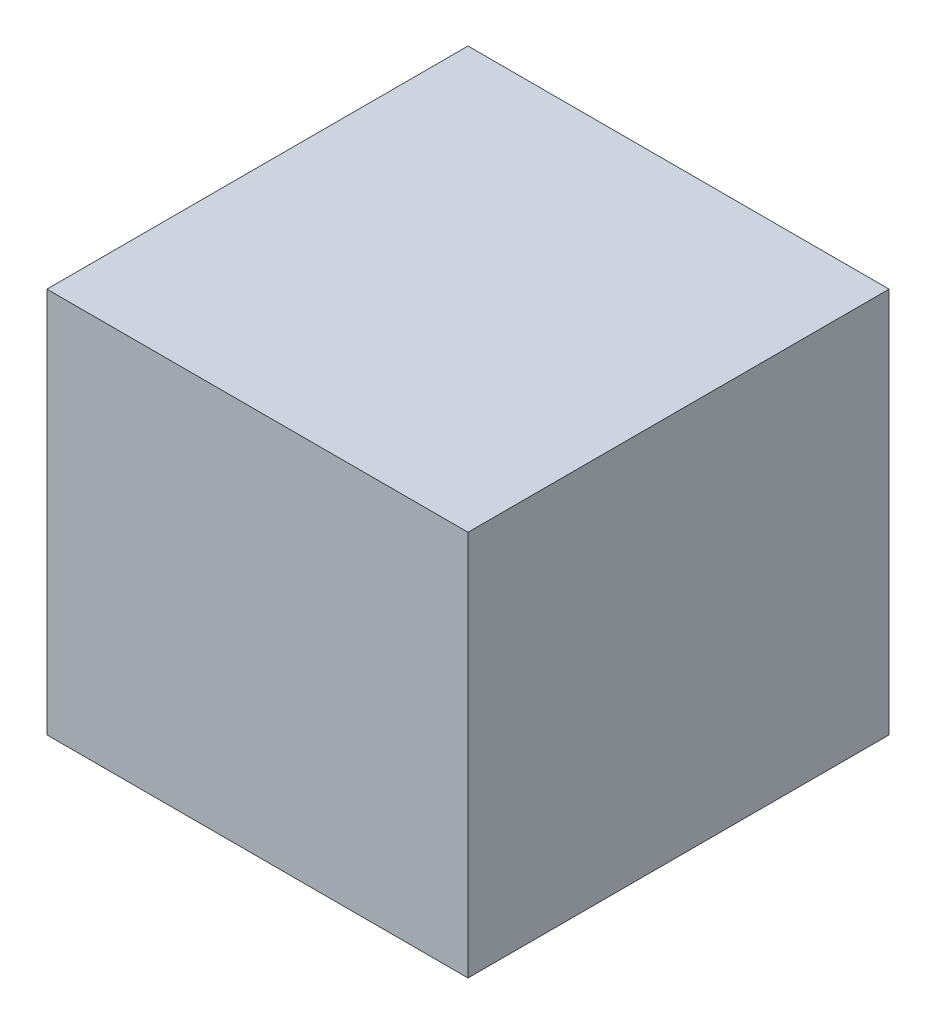
ISO-10303-21;
HEADER;
FILE_DESCRIPTION(('STEP AP214'),'2;1');
FILE_NAME('part.step','',(''),(''),'','','');
FILE_SCHEMA(('AUTOMOTIVE_DESIGN { 1 0 10303 214 1 1 1 1 }'));
ENDSEC;
DATA;
#1=APPLICATION_CONTEXT('core data for automotive mechanical design processes');
#2=APPLICATION_PROTOCOL_DEFINITION('international standard','automotive_design',2000,#1);
#3=PRODUCT_CONTEXT('',#1,'mechanical');
#4=PRODUCT('Part','Part','',(#3));
#5=PRODUCT_RELATED_PRODUCT_CATEGORY('part','',(#4));
#6=PRODUCT_DEFINITION_FORMATION('','',#4);
#7=PRODUCT_DEFINITION_CONTEXT('part definition',#1,'design');
#8=PRODUCT_DEFINITION('design','',#6,#7);
#9=PRODUCT_DEFINITION_SHAPE('','',#8);
#10=(LENGTH_UNIT() NAMED_UNIT(*) SI_UNIT(.MILLI.,.METRE.));
#11=(NAMED_UNIT(*) PLANE_ANGLE_UNIT() SI_UNIT($,.RADIAN.));
#12=(NAMED_UNIT(*) SI_UNIT($,.STERADIAN.) SOLID_ANGLE_UNIT());
#13=UNCERTAINTY_MEASURE_WITH_UNIT(LENGTH_MEASURE(1.E-05),#10,'distance_accuracy_value','');
#14=(GEOMETRIC_REPRESENTATION_CONTEXT(3) GLOBAL_UNCERTAINTY_ASSIGNED_CONTEXT((#13)) GLOBAL_UNIT_ASSIGNED_CONTEXT((#10,
#11,#12)) REPRESENTATION_CONTEXT('',''));
#15=CARTESIAN_POINT('',(0.,0.,0.));
#16=DIRECTION('',(0.,0.,1.));
#17=DIRECTION('',(1.,0.,0.));
#18=AXIS2_PLACEMENT_3D('',#15,#16,#17);
#19=CARTESIAN_POINT('',(0.,0.,304.8));
#20=DIRECTION('',(1.,0.,0.));
#21=DIRECTION('',(0.,1.,0.));
#22=AXIS2_PLACEMENT_3D('',#19,#20,#21);
#23=PLANE('',#22);
#24=DIRECTION('',(0.,-1.,0.));
#25=VECTOR('',#24,1.);
#26=CARTESIAN_POINT('',(0.,0.,0.));
#27=LINE('',#26,#25);
#28=CARTESIAN_POINT('',(0.,279.4,0.));
#29=VERTEX_POINT('',#28);
#30=CARTESIAN_POINT('',(0.,0.,0.));
#31=VERTEX_POINT('',#30);
#32=EDGE_CURVE('E95',#29,#31,#27,.T.);
#33=ORIENTED_EDGE('',*,*,#32,.T.);
#34=DIRECTION('',(0.,0.,-1.));
#35=VECTOR('',#34,1.);
#36=CARTESIAN_POINT('',(0.,0.,304.8));
#37=LINE('',#36,#35);
#38=CARTESIAN_POINT('',(0.,0.,304.8));
#39=VERTEX_POINT('',#38);
#40=EDGE_CURVE('E11',#39,#31,#37,.T.);
#41=ORIENTED_EDGE('',*,*,#40,.F.);
#42=DIRECTION('',(0.,-1.,0.));
#43=VECTOR('',#42,1.);
#44=CARTESIAN_POINT('',(0.,0.,304.8));
#45=LINE('',#44,#43);
#46=CARTESIAN_POINT('',(0.,279.4,304.8));
#47=VERTEX_POINT('',#46);
#48=EDGE_CURVE('E83',#47,#39,#45,.T.);
#49=ORIENTED_EDGE('',*,*,#48,.F.);
#50=DIRECTION('',(0.,0.,-1.));
#51=VECTOR('',#50,1.);
#52=CARTESIAN_POINT('',(0.,279.4,304.8));
#53=LINE('',#52,#51);
#54=EDGE_CURVE('E91',#47,#29,#53,.T.);
#55=ORIENTED_EDGE('',*,*,#54,.T.);
#56=EDGE_LOOP('',(#33,#41,#49,#55));
#57=FACE_BOUND('',#56,.T.);
#58=ADVANCED_FACE('F32',(#57),#23,.F.);
#59=CARTESIAN_POINT('',(0.,0.,304.8));
#60=DIRECTION('',(0.,1.,0.));
#61=DIRECTION('',(0.,0.,1.));
#62=AXIS2_PLACEMENT_3D('',#59,#60,#61);
#63=PLANE('',#62);
#64=DIRECTION('',(1.,0.,0.));
#65=VECTOR('',#64,1.);
#66=CARTESIAN_POINT('',(0.,0.,0.));
#67=LINE('',#66,#65);
#68=CARTESIAN_POINT('',(304.8,0.,0.));
#69=VERTEX_POINT('',#68);
#70=EDGE_CURVE('E87',#31,#69,#67,.T.);
#71=ORIENTED_EDGE('',*,*,#70,.T.);
#72=DIRECTION('',(0.,0.,-1.));
#73=VECTOR('',#72,1.);
#74=CARTESIAN_POINT('',(304.8,0.,304.8));
#75=LINE('',#74,#73);
#76=CARTESIAN_POINT('',(304.8,0.,304.8));
#77=VERTEX_POINT('',#76);
#78=EDGE_CURVE('E40',#77,#69,#75,.T.);
#79=ORIENTED_EDGE('',*,*,#78,.F.);
#80=DIRECTION('',(1.,0.,0.));
#81=VECTOR('',#80,1.);
#82=CARTESIAN_POINT('',(0.,0.,304.8));
#83=LINE('',#82,#81);
#84=EDGE_CURVE('E78',#39,#77,#83,.T.);
#85=ORIENTED_EDGE('',*,*,#84,.F.);
#86=ORIENTED_EDGE('',*,*,#40,.T.);
#87=EDGE_LOOP('',(#71,#79,#85,#86));
#88=FACE_BOUND('',#87,.T.);
#89=ADVANCED_FACE('F86',(#88),#63,.F.);
#90=CARTESIAN_POINT('',(304.8,0.,304.8));
#91=DIRECTION('',(-1.,0.,0.));
#92=DIRECTION('',(0.,-1.,0.));
#93=AXIS2_PLACEMENT_3D('',#90,#91,#92);
#94=PLANE('',#93);
#95=DIRECTION('',(0.,1.,0.));
#96=VECTOR('',#95,1.);
#97=CARTESIAN_POINT('',(304.8,0.,0.));
#98=LINE('',#97,#96);
#99=CARTESIAN_POINT('',(304.8,279.4,0.));
#100=VERTEX_POINT('',#99);
#101=EDGE_CURVE('E65',#69,#100,#98,.T.);
#102=ORIENTED_EDGE('',*,*,#101,.T.);
#103=DIRECTION('',(0.,0.,-1.));
#104=VECTOR('',#103,1.);
#105=CARTESIAN_POINT('',(304.8,279.4,304.8));
#106=LINE('',#105,#104);
#107=CARTESIAN_POINT('',(304.8,279.4,304.8));
#108=VERTEX_POINT('',#107);
#109=EDGE_CURVE('E88',#108,#100,#106,.T.);
#110=ORIENTED_EDGE('',*,*,#109,.F.);
#111=DIRECTION('',(0.,1.,0.));
#112=VECTOR('',#111,1.);
#113=CARTESIAN_POINT('',(304.8,0.,304.8));
#114=LINE('',#113,#112);
#115=EDGE_CURVE('E81',#77,#108,#114,.T.);
#116=ORIENTED_EDGE('',*,*,#115,.F.);
#117=ORIENTED_EDGE('',*,*,#78,.T.);
#118=EDGE_LOOP('',(#102,#110,#116,#117));
#119=FACE_BOUND('',#118,.T.);
#120=ADVANCED_FACE('F89',(#119),#94,.F.);
#121=CARTESIAN_POINT('',(0.,279.4,304.8));
#122=DIRECTION('',(0.,-1.,0.));
#123=DIRECTION('',(0.,0.,-1.));
#124=AXIS2_PLACEMENT_3D('',#121,#122,#123);
#125=PLANE('',#124);
#126=DIRECTION('',(-1.,0.,0.));
#127=VECTOR('',#126,1.);
#128=CARTESIAN_POINT('',(0.,279.4,0.));
#129=LINE('',#128,#127);
#130=EDGE_CURVE('E71',#100,#29,#129,.T.);
#131=ORIENTED_EDGE('',*,*,#130,.T.);
#132=ORIENTED_EDGE('',*,*,#54,.F.);
#133=DIRECTION('',(-1.,0.,0.));
#134=VECTOR('',#133,1.);
#135=CARTESIAN_POINT('',(0.,279.4,304.8));
#136=LINE('',#135,#134);
#137=EDGE_CURVE('E48',#108,#47,#136,.T.);
#138=ORIENTED_EDGE('',*,*,#137,.F.);
#139=ORIENTED_EDGE('',*,*,#109,.T.);
#140=EDGE_LOOP('',(#131,#132,#138,#139));
#141=FACE_BOUND('',#140,.T.);
#142=ADVANCED_FACE('F102',(#141),#125,.F.);
#143=CARTESIAN_POINT('',(0.,0.,304.8));
#144=DIRECTION('',(0.,0.,-1.));
#145=DIRECTION('',(-1.,0.,0.));
#146=AXIS2_PLACEMENT_3D('',#143,#144,#145);
#147=PLANE('',#146);
#148=ORIENTED_EDGE('',*,*,#48,.T.);
#149=ORIENTED_EDGE('',*,*,#84,.T.);
#150=ORIENTED_EDGE('',*,*,#115,.T.);
#151=ORIENTED_EDGE('',*,*,#137,.T.);
#152=EDGE_LOOP('',(#148,#149,#150,#151));
#153=FACE_BOUND('',#152,.T.);
#154=ADVANCED_FACE('F79',(#153),#147,.F.);
#155=CARTESIAN_POINT('',(0.,0.,0.));
#156=DIRECTION('',(0.,0.,-1.));
#157=DIRECTION('',(-1.,0.,0.));
#158=AXIS2_PLACEMENT_3D('',#155,#156,#157);
#159=PLANE('',#158);
#160=ORIENTED_EDGE('',*,*,#32,.F.);
#161=ORIENTED_EDGE('',*,*,#130,.F.);
#162=ORIENTED_EDGE('',*,*,#101,.F.);
#163=ORIENTED_EDGE('',*,*,#70,.F.);
#164=EDGE_LOOP('',(#160,#161,#162,#163));
#165=FACE_BOUND('',#164,.T.);
#166=ADVANCED_FACE('F105',(#165),#159,.T.);
#167=CLOSED_SHELL('',(#58,#89,#120,#142,#154,#166));
#168=MANIFOLD_SOLID_BREP('B2',#167);
#169=ADVANCED_BREP_SHAPE_REPRESENTATION('',(#18,#168),#14);
#170=SHAPE_DEFINITION_REPRESENTATION(#9,#169);
ENDSEC;
END-ISO-10303-21;
